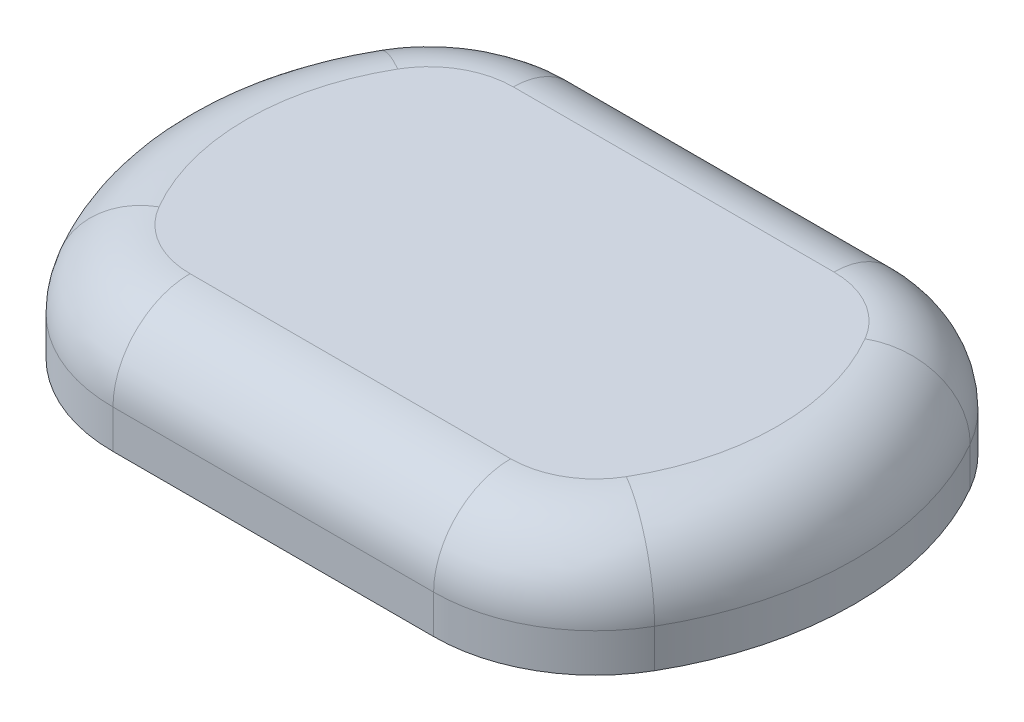
ISO-10303-21;
HEADER;
FILE_DESCRIPTION(('STEP AP214'),'2;1');
FILE_NAME('part.step','',(''),(''),'','','');
FILE_SCHEMA(('AUTOMOTIVE_DESIGN { 1 0 10303 214 1 1 1 1 }'));
ENDSEC;
DATA;
#1=APPLICATION_CONTEXT('core data for automotive mechanical design processes');
#2=APPLICATION_PROTOCOL_DEFINITION('international standard','automotive_design',2000,#1);
#3=PRODUCT_CONTEXT('',#1,'mechanical');
#4=PRODUCT('Part','Part','',(#3));
#5=PRODUCT_RELATED_PRODUCT_CATEGORY('part','',(#4));
#6=PRODUCT_DEFINITION_FORMATION('','',#4);
#7=PRODUCT_DEFINITION_CONTEXT('part definition',#1,'design');
#8=PRODUCT_DEFINITION('design','',#6,#7);
#9=PRODUCT_DEFINITION_SHAPE('','',#8);
#10=(LENGTH_UNIT() NAMED_UNIT(*) SI_UNIT(.MILLI.,.METRE.));
#11=(NAMED_UNIT(*) PLANE_ANGLE_UNIT() SI_UNIT($,.RADIAN.));
#12=(NAMED_UNIT(*) SI_UNIT($,.STERADIAN.) SOLID_ANGLE_UNIT());
#13=UNCERTAINTY_MEASURE_WITH_UNIT(LENGTH_MEASURE(1.E-05),#10,'distance_accuracy_value','');
#14=(GEOMETRIC_REPRESENTATION_CONTEXT(3) GLOBAL_UNCERTAINTY_ASSIGNED_CONTEXT((#13)) GLOBAL_UNIT_ASSIGNED_CONTEXT((#10,
#11,#12)) REPRESENTATION_CONTEXT('',''));
#15=CARTESIAN_POINT('',(0.,0.,0.));
#16=DIRECTION('',(0.,0.,1.));
#17=DIRECTION('',(1.,0.,0.));
#18=AXIS2_PLACEMENT_3D('',#15,#16,#17);
#19=CARTESIAN_POINT('',(0.,15.,0.));
#20=DIRECTION('',(0.,-1.,0.));
#21=DIRECTION('',(0.,0.,-1.));
#22=AXIS2_PLACEMENT_3D('',#19,#20,#21);
#23=PLANE('',#22);
#24=CARTESIAN_POINT('',(13.1205080756888,15.,20.2888888888889));
#25=DIRECTION('',(0.,-1.,0.));
#26=DIRECTION('',(0.,0.,-1.));
#27=AXIS2_PLACEMENT_3D('',#24,#25,#26);
#28=CIRCLE('',#27,11.);
#29=CARTESIAN_POINT('',(13.1205080756888,15.,31.2888888888889));
#30=VERTEX_POINT('',#29);
#31=CARTESIAN_POINT('',(22.6467875173176,15.,25.7888888888889));
#32=VERTEX_POINT('',#31);
#33=EDGE_CURVE('E179',#30,#32,#28,.F.);
#34=ORIENTED_EDGE('',*,*,#33,.T.);
#35=CARTESIAN_POINT('',(-4.20000000000001,15.,10.2888888888889));
#36=DIRECTION('',(0.,-1.,0.));
#37=DIRECTION('',(0.,0.,-1.));
#38=AXIS2_PLACEMENT_3D('',#35,#36,#37);
#39=CIRCLE('',#38,31.);
#40=CARTESIAN_POINT('',(22.6467875173176,15.,-5.21111111111112));
#41=VERTEX_POINT('',#40);
#42=EDGE_CURVE('E182',#32,#41,#39,.F.);
#43=ORIENTED_EDGE('',*,*,#42,.T.);
#44=CARTESIAN_POINT('',(13.1205080756888,15.,0.288888888888884));
#45=DIRECTION('',(0.,-1.,0.));
#46=DIRECTION('',(0.,0.,-1.));
#47=AXIS2_PLACEMENT_3D('',#44,#45,#46);
#48=CIRCLE('',#47,11.);
#49=CARTESIAN_POINT('',(13.1205080756888,15.,-10.7111111111111));
#50=VERTEX_POINT('',#49);
#51=EDGE_CURVE('E153',#41,#50,#48,.F.);
#52=ORIENTED_EDGE('',*,*,#51,.T.);
#53=DIRECTION('',(-1.,0.,0.));
#54=VECTOR('',#53,1.);
#55=CARTESIAN_POINT('',(0.,15.,-10.7111111111111));
#56=LINE('',#55,#54);
#57=CARTESIAN_POINT('',(-28.5205080756888,15.,-10.7111111111111));
#58=VERTEX_POINT('',#57);
#59=EDGE_CURVE('E158',#50,#58,#56,.T.);
#60=ORIENTED_EDGE('',*,*,#59,.T.);
#61=CARTESIAN_POINT('',(-28.5205080756888,15.,0.288888888888884));
#62=DIRECTION('',(0.,-1.,0.));
#63=DIRECTION('',(0.,0.,-1.));
#64=AXIS2_PLACEMENT_3D('',#61,#62,#63);
#65=CIRCLE('',#64,11.);
#66=CARTESIAN_POINT('',(-38.0467875173176,15.,-5.21111111111113));
#67=VERTEX_POINT('',#66);
#68=EDGE_CURVE('E167',#58,#67,#65,.F.);
#69=ORIENTED_EDGE('',*,*,#68,.T.);
#70=CARTESIAN_POINT('',(-11.2,15.,10.2888888888889));
#71=DIRECTION('',(0.,-1.,0.));
#72=DIRECTION('',(0.,0.,-1.));
#73=AXIS2_PLACEMENT_3D('',#70,#71,#72);
#74=CIRCLE('',#73,31.);
#75=CARTESIAN_POINT('',(-38.0467875173176,15.,25.7888888888889));
#76=VERTEX_POINT('',#75);
#77=EDGE_CURVE('E170',#67,#76,#74,.F.);
#78=ORIENTED_EDGE('',*,*,#77,.T.);
#79=CARTESIAN_POINT('',(-28.5205080756888,15.,20.2888888888889));
#80=DIRECTION('',(0.,-1.,0.));
#81=DIRECTION('',(0.,0.,-1.));
#82=AXIS2_PLACEMENT_3D('',#79,#80,#81);
#83=CIRCLE('',#82,11.);
#84=CARTESIAN_POINT('',(-28.5205080756888,15.,31.2888888888889));
#85=VERTEX_POINT('',#84);
#86=EDGE_CURVE('E173',#76,#85,#83,.F.);
#87=ORIENTED_EDGE('',*,*,#86,.T.);
#88=DIRECTION('',(1.,0.,0.));
#89=VECTOR('',#88,1.);
#90=CARTESIAN_POINT('',(0.,15.,31.2888888888889));
#91=LINE('',#90,#89);
#92=EDGE_CURVE('E176',#85,#30,#91,.T.);
#93=ORIENTED_EDGE('',*,*,#92,.T.);
#94=EDGE_LOOP('',(#34,#43,#52,#60,#69,#78,#87,#93));
#95=FACE_BOUND('',#94,.T.);
#96=ADVANCED_FACE('F39',(#95),#23,.F.);
#97=CARTESIAN_POINT('',(0.,0.,0.));
#98=DIRECTION('',(0.,-1.,0.));
#99=DIRECTION('',(0.,0.,-1.));
#100=AXIS2_PLACEMENT_3D('',#97,#98,#99);
#101=PLANE('',#100);
#102=DIRECTION('',(-1.,0.,0.));
#103=VECTOR('',#102,1.);
#104=CARTESIAN_POINT('',(-52.2,0.,-20.7111111111111));
#105=LINE('',#104,#103);
#106=CARTESIAN_POINT('',(13.1205080756888,0.,-20.7111111111111));
#107=VERTEX_POINT('',#106);
#108=CARTESIAN_POINT('',(-28.5205080756888,0.,-20.7111111111111));
#109=VERTEX_POINT('',#108);
#110=EDGE_CURVE('E144',#107,#109,#105,.T.);
#111=ORIENTED_EDGE('',*,*,#110,.F.);
#112=CARTESIAN_POINT('',(13.1205080756888,0.,0.288888888888884));
#113=DIRECTION('',(0.,-1.,0.));
#114=DIRECTION('',(0.,0.,-1.));
#115=AXIS2_PLACEMENT_3D('',#112,#113,#114);
#116=CIRCLE('',#115,21.);
#117=CARTESIAN_POINT('',(31.307041555162,0.,-10.2111111111111));
#118=VERTEX_POINT('',#117);
#119=EDGE_CURVE('E131',#118,#107,#116,.F.);
#120=ORIENTED_EDGE('',*,*,#119,.F.);
#121=CARTESIAN_POINT('',(-4.20000000000001,0.,10.2888888888889));
#122=DIRECTION('',(0.,-1.,0.));
#123=DIRECTION('',(0.,0.,-1.));
#124=AXIS2_PLACEMENT_3D('',#121,#122,#123);
#125=CIRCLE('',#124,41.);
#126=CARTESIAN_POINT('',(31.307041555162,0.,30.7888888888889));
#127=VERTEX_POINT('',#126);
#128=EDGE_CURVE('E257',#127,#118,#125,.F.);
#129=ORIENTED_EDGE('',*,*,#128,.F.);
#130=CARTESIAN_POINT('',(13.1205080756888,0.,20.2888888888889));
#131=DIRECTION('',(0.,-1.,0.));
#132=DIRECTION('',(0.,0.,-1.));
#133=AXIS2_PLACEMENT_3D('',#130,#131,#132);
#134=CIRCLE('',#133,21.);
#135=CARTESIAN_POINT('',(13.1205080756888,0.,41.2888888888889));
#136=VERTEX_POINT('',#135);
#137=EDGE_CURVE('E252',#136,#127,#134,.F.);
#138=ORIENTED_EDGE('',*,*,#137,.F.);
#139=DIRECTION('',(1.,0.,0.));
#140=VECTOR('',#139,1.);
#141=CARTESIAN_POINT('',(36.8,0.,41.2888888888889));
#142=LINE('',#141,#140);
#143=CARTESIAN_POINT('',(-28.5205080756888,0.,41.2888888888889));
#144=VERTEX_POINT('',#143);
#145=EDGE_CURVE('E154',#144,#136,#142,.T.);
#146=ORIENTED_EDGE('',*,*,#145,.F.);
#147=CARTESIAN_POINT('',(-28.5205080756888,0.,20.2888888888889));
#148=DIRECTION('',(0.,-1.,0.));
#149=DIRECTION('',(0.,0.,-1.));
#150=AXIS2_PLACEMENT_3D('',#147,#148,#149);
#151=CIRCLE('',#150,21.);
#152=CARTESIAN_POINT('',(-46.707041555162,0.,30.7888888888889));
#153=VERTEX_POINT('',#152);
#154=EDGE_CURVE('E270',#153,#144,#151,.F.);
#155=ORIENTED_EDGE('',*,*,#154,.F.);
#156=CARTESIAN_POINT('',(-11.2,0.,10.2888888888889));
#157=DIRECTION('',(0.,-1.,0.));
#158=DIRECTION('',(0.,0.,-1.));
#159=AXIS2_PLACEMENT_3D('',#156,#157,#158);
#160=CIRCLE('',#159,41.);
#161=CARTESIAN_POINT('',(-46.707041555162,0.,-10.2111111111111));
#162=VERTEX_POINT('',#161);
#163=EDGE_CURVE('E259',#162,#153,#160,.F.);
#164=ORIENTED_EDGE('',*,*,#163,.F.);
#165=CARTESIAN_POINT('',(-28.5205080756888,0.,0.288888888888884));
#166=DIRECTION('',(0.,-1.,0.));
#167=DIRECTION('',(0.,0.,-1.));
#168=AXIS2_PLACEMENT_3D('',#165,#166,#167);
#169=CIRCLE('',#168,21.);
#170=EDGE_CURVE('E151',#109,#162,#169,.F.);
#171=ORIENTED_EDGE('',*,*,#170,.F.);
#172=EDGE_LOOP('',(#111,#120,#129,#138,#146,#155,#164,#171));
#173=FACE_BOUND('',#172,.T.);
#174=ADVANCED_FACE('F148',(#173),#101,.T.);
#175=CARTESIAN_POINT('',(-52.2,15.,-20.7111111111111));
#176=DIRECTION('',(0.,0.,1.));
#177=DIRECTION('',(1.,0.,0.));
#178=AXIS2_PLACEMENT_3D('',#175,#176,#177);
#179=PLANE('',#178);
#180=DIRECTION('',(0.,1.,0.));
#181=VECTOR('',#180,1.);
#182=CARTESIAN_POINT('',(-28.5205080756888,-0.000999999999999265,-20.7111111111111));
#183=LINE('',#182,#181);
#184=CARTESIAN_POINT('',(-28.5205080756888,5.,-20.7111111111111));
#185=VERTEX_POINT('',#184);
#186=EDGE_CURVE('E253',#185,#109,#183,.F.);
#187=ORIENTED_EDGE('',*,*,#186,.F.);
#188=DIRECTION('',(-1.,0.,0.));
#189=VECTOR('',#188,1.);
#190=CARTESIAN_POINT('',(-52.2,5.,-20.7111111111111));
#191=LINE('',#190,#189);
#192=CARTESIAN_POINT('',(13.1205080756888,5.,-20.7111111111111));
#193=VERTEX_POINT('',#192);
#194=EDGE_CURVE('E49',#185,#193,#191,.F.);
#195=ORIENTED_EDGE('',*,*,#194,.T.);
#196=DIRECTION('',(0.,1.,0.));
#197=VECTOR('',#196,1.);
#198=CARTESIAN_POINT('',(13.1205080756888,-0.000999999999999265,-20.7111111111111));
#199=LINE('',#198,#197);
#200=EDGE_CURVE('E133',#107,#193,#199,.T.);
#201=ORIENTED_EDGE('',*,*,#200,.F.);
#202=ORIENTED_EDGE('',*,*,#110,.T.);
#203=EDGE_LOOP('',(#187,#195,#201,#202));
#204=FACE_BOUND('',#203,.T.);
#205=ADVANCED_FACE('F143',(#204),#179,.F.);
#206=CARTESIAN_POINT('',(36.8,15.,41.2888888888889));
#207=DIRECTION('',(0.,0.,-1.));
#208=DIRECTION('',(-1.,0.,0.));
#209=AXIS2_PLACEMENT_3D('',#206,#207,#208);
#210=PLANE('',#209);
#211=DIRECTION('',(0.,1.,0.));
#212=VECTOR('',#211,1.);
#213=CARTESIAN_POINT('',(13.1205080756888,-0.000999999999999265,41.2888888888889));
#214=LINE('',#213,#212);
#215=CARTESIAN_POINT('',(13.1205080756888,5.,41.2888888888889));
#216=VERTEX_POINT('',#215);
#217=EDGE_CURVE('E285',#216,#136,#214,.F.);
#218=ORIENTED_EDGE('',*,*,#217,.F.);
#219=DIRECTION('',(1.,0.,0.));
#220=VECTOR('',#219,1.);
#221=CARTESIAN_POINT('',(36.8,5.,41.2888888888889));
#222=LINE('',#221,#220);
#223=CARTESIAN_POINT('',(-28.5205080756888,5.,41.2888888888889));
#224=VERTEX_POINT('',#223);
#225=EDGE_CURVE('E193',#216,#224,#222,.F.);
#226=ORIENTED_EDGE('',*,*,#225,.T.);
#227=DIRECTION('',(0.,1.,0.));
#228=VECTOR('',#227,1.);
#229=CARTESIAN_POINT('',(-28.5205080756888,-0.000999999999999265,41.2888888888889));
#230=LINE('',#229,#228);
#231=EDGE_CURVE('E273',#144,#224,#230,.T.);
#232=ORIENTED_EDGE('',*,*,#231,.F.);
#233=ORIENTED_EDGE('',*,*,#145,.T.);
#234=EDGE_LOOP('',(#218,#226,#232,#233));
#235=FACE_BOUND('',#234,.T.);
#236=ADVANCED_FACE('F317',(#235),#210,.F.);
#237=CARTESIAN_POINT('',(-11.2,-0.000999999999999265,10.2888888888889));
#238=DIRECTION('',(0.,1.,0.));
#239=DIRECTION('',(0.,0.,1.));
#240=AXIS2_PLACEMENT_3D('',#237,#238,#239);
#241=CYLINDRICAL_SURFACE('',#240,41.);
#242=DIRECTION('',(0.,1.,0.));
#243=VECTOR('',#242,1.);
#244=CARTESIAN_POINT('',(-46.707041555162,-0.000999999999999265,30.7888888888889));
#245=LINE('',#244,#243);
#246=CARTESIAN_POINT('',(-46.707041555162,5.,30.7888888888889));
#247=VERTEX_POINT('',#246);
#248=EDGE_CURVE('E249',#153,#247,#245,.T.);
#249=ORIENTED_EDGE('',*,*,#248,.T.);
#250=CARTESIAN_POINT('',(-11.2,5.,10.2888888888889));
#251=DIRECTION('',(0.,-1.,0.));
#252=DIRECTION('',(0.,0.,-1.));
#253=AXIS2_PLACEMENT_3D('',#250,#251,#252);
#254=CIRCLE('',#253,41.);
#255=CARTESIAN_POINT('',(-46.707041555162,5.,-10.2111111111111));
#256=VERTEX_POINT('',#255);
#257=EDGE_CURVE('E199',#247,#256,#254,.T.);
#258=ORIENTED_EDGE('',*,*,#257,.T.);
#259=DIRECTION('',(0.,1.,0.));
#260=VECTOR('',#259,1.);
#261=CARTESIAN_POINT('',(-46.707041555162,-0.000999999999999265,-10.2111111111111));
#262=LINE('',#261,#260);
#263=EDGE_CURVE('E247',#162,#256,#262,.T.);
#264=ORIENTED_EDGE('',*,*,#263,.F.);
#265=ORIENTED_EDGE('',*,*,#163,.T.);
#266=EDGE_LOOP('',(#249,#258,#264,#265));
#267=FACE_BOUND('',#266,.T.);
#268=ADVANCED_FACE('F246',(#267),#241,.T.);
#269=CARTESIAN_POINT('',(-28.5205080756888,-0.000999999999999265,0.288888888888884));
#270=DIRECTION('',(0.,1.,0.));
#271=DIRECTION('',(0.,0.,1.));
#272=AXIS2_PLACEMENT_3D('',#269,#270,#271);
#273=CYLINDRICAL_SURFACE('',#272,21.);
#274=ORIENTED_EDGE('',*,*,#263,.T.);
#275=CARTESIAN_POINT('',(-28.5205080756888,5.,0.288888888888884));
#276=DIRECTION('',(0.,-1.,0.));
#277=DIRECTION('',(0.,0.,-1.));
#278=AXIS2_PLACEMENT_3D('',#275,#276,#277);
#279=CIRCLE('',#278,21.);
#280=EDGE_CURVE('E64',#256,#185,#279,.T.);
#281=ORIENTED_EDGE('',*,*,#280,.T.);
#282=ORIENTED_EDGE('',*,*,#186,.T.);
#283=ORIENTED_EDGE('',*,*,#170,.T.);
#284=EDGE_LOOP('',(#274,#281,#282,#283));
#285=FACE_BOUND('',#284,.T.);
#286=ADVANCED_FACE('F250',(#285),#273,.T.);
#287=CARTESIAN_POINT('',(13.1205080756888,-0.000999999999999265,20.2888888888889));
#288=DIRECTION('',(0.,1.,0.));
#289=DIRECTION('',(0.,0.,1.));
#290=AXIS2_PLACEMENT_3D('',#287,#288,#289);
#291=CYLINDRICAL_SURFACE('',#290,21.);
#292=DIRECTION('',(0.,1.,0.));
#293=VECTOR('',#292,1.);
#294=CARTESIAN_POINT('',(31.307041555162,-0.000999999999999265,30.7888888888889));
#295=LINE('',#294,#293);
#296=CARTESIAN_POINT('',(31.307041555162,5.,30.7888888888889));
#297=VERTEX_POINT('',#296);
#298=EDGE_CURVE('E161',#127,#297,#295,.T.);
#299=ORIENTED_EDGE('',*,*,#298,.T.);
#300=CARTESIAN_POINT('',(13.1205080756888,5.,20.2888888888889));
#301=DIRECTION('',(0.,-1.,0.));
#302=DIRECTION('',(0.,0.,-1.));
#303=AXIS2_PLACEMENT_3D('',#300,#301,#302);
#304=CIRCLE('',#303,21.);
#305=EDGE_CURVE('E190',#297,#216,#304,.T.);
#306=ORIENTED_EDGE('',*,*,#305,.T.);
#307=ORIENTED_EDGE('',*,*,#217,.T.);
#308=ORIENTED_EDGE('',*,*,#137,.T.);
#309=EDGE_LOOP('',(#299,#306,#307,#308));
#310=FACE_BOUND('',#309,.T.);
#311=ADVANCED_FACE('F292',(#310),#291,.T.);
#312=CARTESIAN_POINT('',(-4.20000000000001,-0.000999999999999265,10.2888888888889));
#313=DIRECTION('',(0.,1.,0.));
#314=DIRECTION('',(0.,0.,1.));
#315=AXIS2_PLACEMENT_3D('',#312,#313,#314);
#316=CYLINDRICAL_SURFACE('',#315,41.);
#317=DIRECTION('',(0.,1.,0.));
#318=VECTOR('',#317,1.);
#319=CARTESIAN_POINT('',(31.307041555162,-0.000999999999999265,-10.2111111111111));
#320=LINE('',#319,#318);
#321=CARTESIAN_POINT('',(31.307041555162,5.,-10.2111111111111));
#322=VERTEX_POINT('',#321);
#323=EDGE_CURVE('E136',#118,#322,#320,.T.);
#324=ORIENTED_EDGE('',*,*,#323,.T.);
#325=CARTESIAN_POINT('',(-4.20000000000001,5.,10.2888888888889));
#326=DIRECTION('',(0.,-1.,0.));
#327=DIRECTION('',(0.,0.,-1.));
#328=AXIS2_PLACEMENT_3D('',#325,#326,#327);
#329=CIRCLE('',#328,41.);
#330=EDGE_CURVE('E186',#322,#297,#329,.T.);
#331=ORIENTED_EDGE('',*,*,#330,.T.);
#332=ORIENTED_EDGE('',*,*,#298,.F.);
#333=ORIENTED_EDGE('',*,*,#128,.T.);
#334=EDGE_LOOP('',(#324,#331,#332,#333));
#335=FACE_BOUND('',#334,.T.);
#336=ADVANCED_FACE('F295',(#335),#316,.T.);
#337=CARTESIAN_POINT('',(-28.5205080756888,-0.000999999999999265,20.2888888888889));
#338=DIRECTION('',(0.,1.,0.));
#339=DIRECTION('',(0.,0.,1.));
#340=AXIS2_PLACEMENT_3D('',#337,#338,#339);
#341=CYLINDRICAL_SURFACE('',#340,21.);
#342=ORIENTED_EDGE('',*,*,#231,.T.);
#343=CARTESIAN_POINT('',(-28.5205080756888,5.,20.2888888888889));
#344=DIRECTION('',(0.,-1.,0.));
#345=DIRECTION('',(0.,0.,-1.));
#346=AXIS2_PLACEMENT_3D('',#343,#344,#345);
#347=CIRCLE('',#346,21.);
#348=EDGE_CURVE('E196',#224,#247,#347,.T.);
#349=ORIENTED_EDGE('',*,*,#348,.T.);
#350=ORIENTED_EDGE('',*,*,#248,.F.);
#351=ORIENTED_EDGE('',*,*,#154,.T.);
#352=EDGE_LOOP('',(#342,#349,#350,#351));
#353=FACE_BOUND('',#352,.T.);
#354=ADVANCED_FACE('F269',(#353),#341,.T.);
#355=CARTESIAN_POINT('',(13.1205080756888,-0.000999999999999265,0.288888888888884));
#356=DIRECTION('',(0.,1.,0.));
#357=DIRECTION('',(0.,0.,1.));
#358=AXIS2_PLACEMENT_3D('',#355,#356,#357);
#359=CYLINDRICAL_SURFACE('',#358,21.);
#360=ORIENTED_EDGE('',*,*,#200,.T.);
#361=CARTESIAN_POINT('',(13.1205080756888,5.,0.288888888888884));
#362=DIRECTION('',(0.,-1.,0.));
#363=DIRECTION('',(0.,0.,-1.));
#364=AXIS2_PLACEMENT_3D('',#361,#362,#363);
#365=CIRCLE('',#364,21.);
#366=EDGE_CURVE('E11',#193,#322,#365,.T.);
#367=ORIENTED_EDGE('',*,*,#366,.T.);
#368=ORIENTED_EDGE('',*,*,#323,.F.);
#369=ORIENTED_EDGE('',*,*,#119,.T.);
#370=EDGE_LOOP('',(#360,#367,#368,#369));
#371=FACE_BOUND('',#370,.T.);
#372=ADVANCED_FACE('F132',(#371),#359,.T.);
#373=CARTESIAN_POINT('',(-11.2,5.,10.2888888888889));
#374=DIRECTION('',(0.,-1.,0.));
#375=DIRECTION('',(0.,0.,-1.));
#376=AXIS2_PLACEMENT_3D('',#373,#374,#375);
#377=TOROIDAL_SURFACE('',#376,31.,10.);
#378=CARTESIAN_POINT('',(-38.0467875173176,5.,-5.21111111111113));
#379=DIRECTION('',(0.5,0.,-0.866025403784438));
#380=DIRECTION('',(-0.866025403784438,0.,-0.5));
#381=AXIS2_PLACEMENT_3D('',#378,#379,#380);
#382=CIRCLE('',#381,10.);
#383=EDGE_CURVE('E227',#256,#67,#382,.T.);
#384=ORIENTED_EDGE('',*,*,#383,.F.);
#385=ORIENTED_EDGE('',*,*,#257,.F.);
#386=CARTESIAN_POINT('',(-38.0467875173176,5.,25.7888888888889));
#387=DIRECTION('',(0.5,0.,0.866025403784439));
#388=DIRECTION('',(0.866025403784439,0.,-0.5));
#389=AXIS2_PLACEMENT_3D('',#386,#387,#388);
#390=CIRCLE('',#389,10.);
#391=EDGE_CURVE('E43',#76,#247,#390,.T.);
#392=ORIENTED_EDGE('',*,*,#391,.F.);
#393=ORIENTED_EDGE('',*,*,#77,.F.);
#394=EDGE_LOOP('',(#384,#385,#392,#393));
#395=FACE_BOUND('',#394,.T.);
#396=ADVANCED_FACE('F41',(#395),#377,.T.);
#397=CARTESIAN_POINT('',(-28.5205080756888,5.,20.2888888888889));
#398=DIRECTION('',(0.,-1.,0.));
#399=DIRECTION('',(0.,0.,-1.));
#400=AXIS2_PLACEMENT_3D('',#397,#398,#399);
#401=TOROIDAL_SURFACE('',#400,11.,10.);
#402=ORIENTED_EDGE('',*,*,#391,.T.);
#403=ORIENTED_EDGE('',*,*,#348,.F.);
#404=CARTESIAN_POINT('',(-28.5205080756888,5.,31.2888888888889));
#405=DIRECTION('',(1.,0.,0.));
#406=DIRECTION('',(0.,0.,-1.));
#407=AXIS2_PLACEMENT_3D('',#404,#405,#406);
#408=CIRCLE('',#407,10.);
#409=EDGE_CURVE('E224',#85,#224,#408,.T.);
#410=ORIENTED_EDGE('',*,*,#409,.F.);
#411=ORIENTED_EDGE('',*,*,#86,.F.);
#412=EDGE_LOOP('',(#402,#403,#410,#411));
#413=FACE_BOUND('',#412,.T.);
#414=ADVANCED_FACE('F239',(#413),#401,.T.);
#415=CARTESIAN_POINT('',(-28.5205080756888,5.,0.288888888888884));
#416=DIRECTION('',(0.,-1.,0.));
#417=DIRECTION('',(0.,0.,-1.));
#418=AXIS2_PLACEMENT_3D('',#415,#416,#417);
#419=TOROIDAL_SURFACE('',#418,11.,10.);
#420=ORIENTED_EDGE('',*,*,#383,.T.);
#421=ORIENTED_EDGE('',*,*,#68,.F.);
#422=CARTESIAN_POINT('',(-28.5205080756888,5.,-10.7111111111111));
#423=DIRECTION('',(1.,0.,0.));
#424=DIRECTION('',(0.,0.,-1.));
#425=AXIS2_PLACEMENT_3D('',#422,#423,#424);
#426=CIRCLE('',#425,10.);
#427=EDGE_CURVE('E220',#185,#58,#426,.T.);
#428=ORIENTED_EDGE('',*,*,#427,.F.);
#429=ORIENTED_EDGE('',*,*,#280,.F.);
#430=EDGE_LOOP('',(#420,#421,#428,#429));
#431=FACE_BOUND('',#430,.T.);
#432=ADVANCED_FACE('F349',(#431),#419,.T.);
#433=CARTESIAN_POINT('',(0.,5.,31.2888888888889));
#434=DIRECTION('',(1.,0.,0.));
#435=DIRECTION('',(0.,0.,-1.));
#436=AXIS2_PLACEMENT_3D('',#433,#434,#435);
#437=CYLINDRICAL_SURFACE('',#436,10.);
#438=ORIENTED_EDGE('',*,*,#409,.T.);
#439=ORIENTED_EDGE('',*,*,#225,.F.);
#440=CARTESIAN_POINT('',(13.1205080756888,5.,31.2888888888889));
#441=DIRECTION('',(1.,0.,0.));
#442=DIRECTION('',(0.,0.,-1.));
#443=AXIS2_PLACEMENT_3D('',#440,#441,#442);
#444=CIRCLE('',#443,10.);
#445=EDGE_CURVE('E216',#30,#216,#444,.T.);
#446=ORIENTED_EDGE('',*,*,#445,.F.);
#447=ORIENTED_EDGE('',*,*,#92,.F.);
#448=EDGE_LOOP('',(#438,#439,#446,#447));
#449=FACE_BOUND('',#448,.T.);
#450=ADVANCED_FACE('F315',(#449),#437,.T.);
#451=CARTESIAN_POINT('',(0.,5.,-10.7111111111111));
#452=DIRECTION('',(-1.,0.,0.));
#453=DIRECTION('',(0.,0.,1.));
#454=AXIS2_PLACEMENT_3D('',#451,#452,#453);
#455=CYLINDRICAL_SURFACE('',#454,10.);
#456=ORIENTED_EDGE('',*,*,#427,.T.);
#457=ORIENTED_EDGE('',*,*,#59,.F.);
#458=CARTESIAN_POINT('',(13.1205080756888,5.,-10.7111111111111));
#459=DIRECTION('',(1.,0.,0.));
#460=DIRECTION('',(0.,0.,-1.));
#461=AXIS2_PLACEMENT_3D('',#458,#459,#460);
#462=CIRCLE('',#461,10.);
#463=EDGE_CURVE('E212',#193,#50,#462,.T.);
#464=ORIENTED_EDGE('',*,*,#463,.F.);
#465=ORIENTED_EDGE('',*,*,#194,.F.);
#466=EDGE_LOOP('',(#456,#457,#464,#465));
#467=FACE_BOUND('',#466,.T.);
#468=ADVANCED_FACE('F357',(#467),#455,.T.);
#469=CARTESIAN_POINT('',(13.1205080756888,5.,20.2888888888889));
#470=DIRECTION('',(0.,-1.,0.));
#471=DIRECTION('',(0.,0.,-1.));
#472=AXIS2_PLACEMENT_3D('',#469,#470,#471);
#473=TOROIDAL_SURFACE('',#472,11.,10.);
#474=ORIENTED_EDGE('',*,*,#445,.T.);
#475=ORIENTED_EDGE('',*,*,#305,.F.);
#476=CARTESIAN_POINT('',(22.6467875173176,5.,25.7888888888889));
#477=DIRECTION('',(0.5,0.,-0.866025403784438));
#478=DIRECTION('',(-0.866025403784439,0.,-0.5));
#479=AXIS2_PLACEMENT_3D('',#476,#477,#478);
#480=CIRCLE('',#479,10.);
#481=EDGE_CURVE('E209',#32,#297,#480,.T.);
#482=ORIENTED_EDGE('',*,*,#481,.F.);
#483=ORIENTED_EDGE('',*,*,#33,.F.);
#484=EDGE_LOOP('',(#474,#475,#482,#483));
#485=FACE_BOUND('',#484,.T.);
#486=ADVANCED_FACE('F312',(#485),#473,.T.);
#487=CARTESIAN_POINT('',(13.1205080756888,5.,0.288888888888884));
#488=DIRECTION('',(0.,-1.,0.));
#489=DIRECTION('',(0.,0.,-1.));
#490=AXIS2_PLACEMENT_3D('',#487,#488,#489);
#491=TOROIDAL_SURFACE('',#490,11.,10.);
#492=ORIENTED_EDGE('',*,*,#463,.T.);
#493=ORIENTED_EDGE('',*,*,#51,.F.);
#494=CARTESIAN_POINT('',(22.6467875173176,5.,-5.21111111111112));
#495=DIRECTION('',(0.5,0.,0.866025403784438));
#496=DIRECTION('',(0.866025403784439,0.,-0.5));
#497=AXIS2_PLACEMENT_3D('',#494,#495,#496);
#498=CIRCLE('',#497,10.);
#499=EDGE_CURVE('E206',#322,#41,#498,.T.);
#500=ORIENTED_EDGE('',*,*,#499,.F.);
#501=ORIENTED_EDGE('',*,*,#366,.F.);
#502=EDGE_LOOP('',(#492,#493,#500,#501));
#503=FACE_BOUND('',#502,.T.);
#504=ADVANCED_FACE('F305',(#503),#491,.T.);
#505=CARTESIAN_POINT('',(-4.20000000000001,5.,10.2888888888889));
#506=DIRECTION('',(0.,-1.,0.));
#507=DIRECTION('',(0.,0.,-1.));
#508=AXIS2_PLACEMENT_3D('',#505,#506,#507);
#509=TOROIDAL_SURFACE('',#508,31.,10.);
#510=ORIENTED_EDGE('',*,*,#481,.T.);
#511=ORIENTED_EDGE('',*,*,#330,.F.);
#512=ORIENTED_EDGE('',*,*,#499,.T.);
#513=ORIENTED_EDGE('',*,*,#42,.F.);
#514=EDGE_LOOP('',(#510,#511,#512,#513));
#515=FACE_BOUND('',#514,.T.);
#516=ADVANCED_FACE('F299',(#515),#509,.T.);
#517=CLOSED_SHELL('',(#96,#174,#205,#236,#268,#286,#311,#336,#354,#372,#396,#414,#432,#450,#468,
#486,#504,#516));
#518=MANIFOLD_SOLID_BREP('B2',#517);
#519=ADVANCED_BREP_SHAPE_REPRESENTATION('',(#18,#518),#14);
#520=SHAPE_DEFINITION_REPRESENTATION(#9,#519);
ENDSEC;
END-ISO-10303-21;
